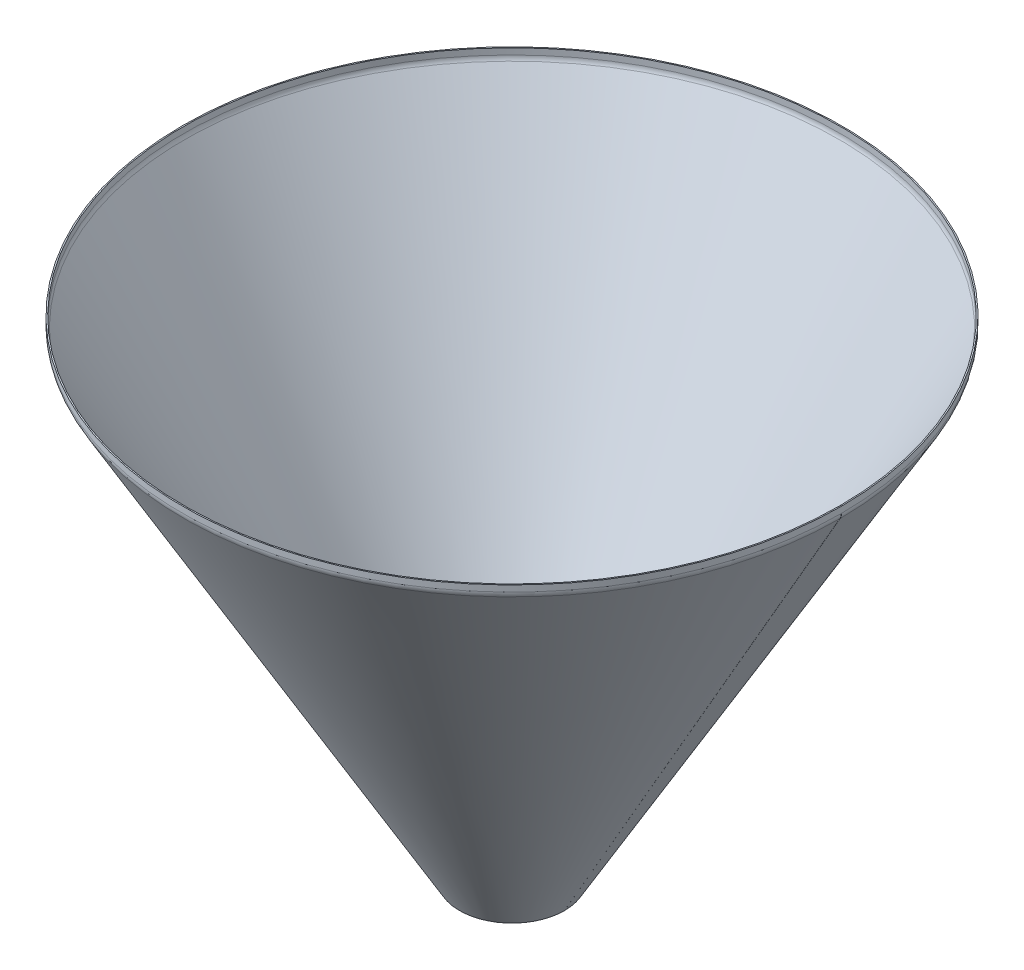
ISO-10303-21;
HEADER;
FILE_DESCRIPTION(('STEP AP214'),'2;1');
FILE_NAME('part.step','',(''),(''),'','','');
FILE_SCHEMA(('AUTOMOTIVE_DESIGN { 1 0 10303 214 1 1 1 1 }'));
ENDSEC;
DATA;
#1=APPLICATION_CONTEXT('core data for automotive mechanical design processes');
#2=APPLICATION_PROTOCOL_DEFINITION('international standard','automotive_design',2000,#1);
#3=PRODUCT_CONTEXT('',#1,'mechanical');
#4=PRODUCT('Part','Part','',(#3));
#5=PRODUCT_RELATED_PRODUCT_CATEGORY('part','',(#4));
#6=PRODUCT_DEFINITION_FORMATION('','',#4);
#7=PRODUCT_DEFINITION_CONTEXT('part definition',#1,'design');
#8=PRODUCT_DEFINITION('design','',#6,#7);
#9=PRODUCT_DEFINITION_SHAPE('','',#8);
#10=(LENGTH_UNIT() NAMED_UNIT(*) SI_UNIT(.MILLI.,.METRE.));
#11=(NAMED_UNIT(*) PLANE_ANGLE_UNIT() SI_UNIT($,.RADIAN.));
#12=(NAMED_UNIT(*) SI_UNIT($,.STERADIAN.) SOLID_ANGLE_UNIT());
#13=UNCERTAINTY_MEASURE_WITH_UNIT(LENGTH_MEASURE(1.E-05),#10,'distance_accuracy_value','');
#14=(GEOMETRIC_REPRESENTATION_CONTEXT(3) GLOBAL_UNCERTAINTY_ASSIGNED_CONTEXT((#13)) GLOBAL_UNIT_ASSIGNED_CONTEXT((#10,
#11,#12)) REPRESENTATION_CONTEXT('',''));
#15=CARTESIAN_POINT('',(0.,0.,0.));
#16=DIRECTION('',(0.,0.,1.));
#17=DIRECTION('',(1.,0.,0.));
#18=AXIS2_PLACEMENT_3D('',#15,#16,#17);
#19=CARTESIAN_POINT('',(-25.0002950981067,-15.,0.676314999307887));
#20=DIRECTION('',(0.000872664515235983,0.,-0.999999619228249));
#21=DIRECTION('',(-0.999999619228249,0.,-0.000872664515235983));
#22=AXIS2_PLACEMENT_3D('',#19,#20,#21);
#23=PLANE('',#22);
#24=DIRECTION('',(-0.999999619228249,0.,-0.000872664515236227));
#25=VECTOR('',#24,1.);
#26=CARTESIAN_POINT('',(-0.000304617400415097,-15.,0.698131612188983));
#27=LINE('',#26,#25);
#28=CARTESIAN_POINT('',(-0.000304617400415097,-15.,0.698131612188983));
#29=VERTEX_POINT('',#28);
#30=CARTESIAN_POINT('',(-3.00030347508518,-14.9999999999999,0.695513618643305));
#31=VERTEX_POINT('',#30);
#32=EDGE_CURVE('E11',#29,#31,#27,.T.);
#33=ORIENTED_EDGE('',*,*,#32,.F.);
#34=CARTESIAN_POINT('',(-25.0002950981067,-15.,0.676314999307887));
#35=DIRECTION('',(-0.000872664515235983,0.,0.999999619228249));
#36=DIRECTION('',(0.999999619228249,0.,0.000872664515235983));
#37=AXIS2_PLACEMENT_3D('',#34,#35,#36);
#38=CIRCLE('',#37,25.);
#39=CARTESIAN_POINT('',(-3.34966824744598,-27.5,0.695208740287472));
#40=VERTEX_POINT('',#39);
#41=EDGE_CURVE('E139',#40,#29,#38,.T.);
#42=ORIENTED_EDGE('',*,*,#41,.F.);
#43=DIRECTION('',(-0.866025074026429,0.500000000000001,-0.000755749639175806));
#44=VECTOR('',#43,1.);
#45=CARTESIAN_POINT('',(-3.34966824744598,-27.5,0.695208740287472));
#46=LINE('',#45,#44);
#47=CARTESIAN_POINT('',(-5.94774346952531,-26.,0.692941491369975));
#48=VERTEX_POINT('',#47);
#49=EDGE_CURVE('E52',#40,#48,#46,.T.);
#50=ORIENTED_EDGE('',*,*,#49,.T.);
#51=CARTESIAN_POINT('',(-25.0002950981068,-15.,0.676314999307935));
#52=DIRECTION('',(-0.000872664515236045,0.,0.999999619228249));
#53=DIRECTION('',(0.999999619228249,0.,0.000872664515236045));
#54=AXIS2_PLACEMENT_3D('',#51,#52,#53);
#55=CIRCLE('',#54,22.);
#56=EDGE_CURVE('E136',#48,#31,#55,.T.);
#57=ORIENTED_EDGE('',*,*,#56,.T.);
#58=EDGE_LOOP('',(#33,#42,#50,#57));
#59=FACE_BOUND('',#58,.T.);
#60=ADVANCED_FACE('F42',(#59),#23,.T.);
#61=CARTESIAN_POINT('',(-3.34966824744592,-27.5,0.695208740287277));
#62=DIRECTION('',(0.000872664515235983,0.,-0.999999619228249));
#63=DIRECTION('',(0.499999809614126,0.866025403784438,0.000436332257617993));
#64=AXIS2_PLACEMENT_3D('',#61,#62,#63);
#65=PLANE('',#64);
#66=ORIENTED_EDGE('',*,*,#49,.F.);
#67=DIRECTION('',(0.499999809614126,0.866025403784438,0.000436332257617993));
#68=VECTOR('',#67,1.);
#69=CARTESIAN_POINT('',(-3.34966824744592,-27.5,0.695208740287277));
#70=LINE('',#69,#68);
#71=CARTESIAN_POINT('',(-672.500048548398,-1186.50289790085,0.111264725692619));
#72=VERTEX_POINT('',#71);
#73=EDGE_CURVE('E179',#72,#40,#70,.T.);
#74=ORIENTED_EDGE('',*,*,#73,.F.);
#75=DIRECTION('',(-0.866025074026429,0.500000000000001,-0.000755749639175805));
#76=VECTOR('',#75,1.);
#77=CARTESIAN_POINT('',(-672.500048548398,-1186.50289790085,0.111264725692619));
#78=LINE('',#77,#76);
#79=CARTESIAN_POINT('',(-675.098123770478,-1185.00289790084,0.108997476775069));
#80=VERTEX_POINT('',#79);
#81=EDGE_CURVE('E128',#72,#80,#78,.T.);
#82=ORIENTED_EDGE('',*,*,#81,.T.);
#83=DIRECTION('',(0.499999809614126,0.866025403784438,0.000436332257618023));
#84=VECTOR('',#83,1.);
#85=CARTESIAN_POINT('',(-675.098123770478,-1185.00289790084,0.108997476775069));
#86=LINE('',#85,#84);
#87=EDGE_CURVE('E156',#80,#48,#86,.T.);
#88=ORIENTED_EDGE('',*,*,#87,.T.);
#89=EDGE_LOOP('',(#66,#74,#82,#88));
#90=FACE_BOUND('',#89,.T.);
#91=ADVANCED_FACE('F157',(#90),#65,.T.);
#92=CARTESIAN_POINT('',(-800.,-1186.50289790085,0.));
#93=DIRECTION('',(0.,-1.,0.));
#94=DIRECTION('',(0.,0.,-1.));
#95=AXIS2_PLACEMENT_3D('',#92,#93,#94);
#96=CONICAL_SURFACE('',#95,127.5,1.0471975511966);
#97=ORIENTED_EDGE('',*,*,#81,.F.);
#98=CARTESIAN_POINT('',(-800.,-1186.50289790085,0.));
#99=DIRECTION('',(0.,1.,0.));
#100=DIRECTION('',(1.,0.,0.));
#101=AXIS2_PLACEMENT_3D('',#98,#99,#100);
#102=CIRCLE('',#101,127.5);
#103=CARTESIAN_POINT('',(-672.5,-1186.50289790085,0.));
#104=VERTEX_POINT('',#103);
#105=EDGE_CURVE('E106',#104,#72,#102,.T.);
#106=ORIENTED_EDGE('',*,*,#105,.F.);
#107=DIRECTION('',(-0.866025403784438,0.500000000000001,0.));
#108=VECTOR('',#107,1.);
#109=CARTESIAN_POINT('',(-672.5,-1186.50289790085,0.));
#110=LINE('',#109,#108);
#111=CARTESIAN_POINT('',(-675.098076211353,-1185.00289790084,0.));
#112=VERTEX_POINT('',#111);
#113=EDGE_CURVE('E125',#104,#112,#110,.T.);
#114=ORIENTED_EDGE('',*,*,#113,.T.);
#115=CARTESIAN_POINT('',(-800.,-1185.00289790084,0.));
#116=DIRECTION('',(0.,1.,0.));
#117=DIRECTION('',(0.,0.,1.));
#118=AXIS2_PLACEMENT_3D('',#115,#116,#117);
#119=CIRCLE('',#118,124.901923788647);
#120=EDGE_CURVE('E161',#112,#80,#119,.T.);
#121=ORIENTED_EDGE('',*,*,#120,.T.);
#122=EDGE_LOOP('',(#97,#106,#114,#121));
#123=FACE_BOUND('',#122,.T.);
#124=ADVANCED_FACE('F218',(#123),#96,.F.);
#125=CARTESIAN_POINT('',(-3.34936490538905,-27.5,0.));
#126=DIRECTION('',(0.,0.,-1.));
#127=DIRECTION('',(0.500000000000001,0.866025403784438,0.));
#128=AXIS2_PLACEMENT_3D('',#125,#126,#127);
#129=PLANE('',#128);
#130=ORIENTED_EDGE('',*,*,#113,.F.);
#131=DIRECTION('',(0.500000000000001,0.866025403784438,0.));
#132=VECTOR('',#131,1.);
#133=CARTESIAN_POINT('',(-3.34936490538905,-27.5,0.));
#134=LINE('',#133,#132);
#135=CARTESIAN_POINT('',(-3.34936490538906,-27.5,0.));
#136=VERTEX_POINT('',#135);
#137=EDGE_CURVE('E176',#104,#136,#134,.T.);
#138=ORIENTED_EDGE('',*,*,#137,.T.);
#139=DIRECTION('',(-0.866025403784438,0.500000000000001,0.));
#140=VECTOR('',#139,1.);
#141=CARTESIAN_POINT('',(-3.34936490538906,-27.5,0.));
#142=LINE('',#141,#140);
#143=CARTESIAN_POINT('',(-5.94744111674239,-26.,0.));
#144=VERTEX_POINT('',#143);
#145=EDGE_CURVE('E122',#136,#144,#142,.T.);
#146=ORIENTED_EDGE('',*,*,#145,.T.);
#147=DIRECTION('',(0.500000000000001,0.866025403784438,0.));
#148=VECTOR('',#147,1.);
#149=CARTESIAN_POINT('',(-675.098076211353,-1185.00289790084,0.));
#150=LINE('',#149,#148);
#151=EDGE_CURVE('E113',#112,#144,#150,.T.);
#152=ORIENTED_EDGE('',*,*,#151,.F.);
#153=EDGE_LOOP('',(#130,#138,#146,#152));
#154=FACE_BOUND('',#153,.T.);
#155=ADVANCED_FACE('F223',(#154),#129,.F.);
#156=CARTESIAN_POINT('',(-25.,-15.,0.));
#157=DIRECTION('',(0.,0.,-1.));
#158=DIRECTION('',(-1.,0.,0.));
#159=AXIS2_PLACEMENT_3D('',#156,#157,#158);
#160=PLANE('',#159);
#161=ORIENTED_EDGE('',*,*,#145,.F.);
#162=CARTESIAN_POINT('',(-25.,-15.,0.));
#163=DIRECTION('',(0.,0.,1.));
#164=DIRECTION('',(1.,0.,0.));
#165=AXIS2_PLACEMENT_3D('',#162,#163,#164);
#166=CIRCLE('',#165,25.);
#167=CARTESIAN_POINT('',(0.,-15.,0.));
#168=VERTEX_POINT('',#167);
#169=EDGE_CURVE('E107',#136,#168,#166,.T.);
#170=ORIENTED_EDGE('',*,*,#169,.T.);
#171=DIRECTION('',(-1.,0.,0.));
#172=VECTOR('',#171,1.);
#173=CARTESIAN_POINT('',(0.,-15.,0.));
#174=LINE('',#173,#172);
#175=CARTESIAN_POINT('',(-3.,-15.,0.));
#176=VERTEX_POINT('',#175);
#177=EDGE_CURVE('E96',#168,#176,#174,.T.);
#178=ORIENTED_EDGE('',*,*,#177,.T.);
#179=CARTESIAN_POINT('',(-25.,-15.,0.));
#180=DIRECTION('',(0.,0.,1.));
#181=DIRECTION('',(1.,0.,0.));
#182=AXIS2_PLACEMENT_3D('',#179,#180,#181);
#183=CIRCLE('',#182,22.);
#184=EDGE_CURVE('E116',#144,#176,#183,.T.);
#185=ORIENTED_EDGE('',*,*,#184,.F.);
#186=EDGE_LOOP('',(#161,#170,#178,#185));
#187=FACE_BOUND('',#186,.T.);
#188=ADVANCED_FACE('F204',(#187),#160,.F.);
#189=CARTESIAN_POINT('',(0.,-7.5,0.));
#190=DIRECTION('',(0.,0.,-1.));
#191=DIRECTION('',(0.,1.,0.));
#192=AXIS2_PLACEMENT_3D('',#189,#190,#191);
#193=PLANE('',#192);
#194=ORIENTED_EDGE('',*,*,#177,.F.);
#195=DIRECTION('',(0.,1.,0.));
#196=VECTOR('',#195,1.);
#197=CARTESIAN_POINT('',(0.,0.,0.));
#198=LINE('',#197,#196);
#199=CARTESIAN_POINT('',(0.,0.,0.));
#200=VERTEX_POINT('',#199);
#201=EDGE_CURVE('E99',#168,#200,#198,.T.);
#202=ORIENTED_EDGE('',*,*,#201,.T.);
#203=DIRECTION('',(-1.,0.,0.));
#204=VECTOR('',#203,1.);
#205=CARTESIAN_POINT('',(0.,0.,0.));
#206=LINE('',#205,#204);
#207=CARTESIAN_POINT('',(-3.,0.,0.));
#208=VERTEX_POINT('',#207);
#209=EDGE_CURVE('E85',#200,#208,#206,.T.);
#210=ORIENTED_EDGE('',*,*,#209,.T.);
#211=DIRECTION('',(0.,1.,0.));
#212=VECTOR('',#211,1.);
#213=CARTESIAN_POINT('',(-3.,-1186.50289790085,0.));
#214=LINE('',#213,#212);
#215=EDGE_CURVE('E171',#176,#208,#214,.T.);
#216=ORIENTED_EDGE('',*,*,#215,.F.);
#217=EDGE_LOOP('',(#194,#202,#210,#216));
#218=FACE_BOUND('',#217,.T.);
#219=ADVANCED_FACE('F100',(#218),#193,.F.);
#220=CARTESIAN_POINT('',(-800.,0.,0.));
#221=DIRECTION('',(0.,-1.,0.));
#222=DIRECTION('',(0.,0.,-1.));
#223=AXIS2_PLACEMENT_3D('',#220,#221,#222);
#224=PLANE('',#223);
#225=ORIENTED_EDGE('',*,*,#209,.F.);
#226=CARTESIAN_POINT('',(-800.,0.,0.));
#227=DIRECTION('',(0.,1.,0.));
#228=DIRECTION('',(1.,0.,0.));
#229=AXIS2_PLACEMENT_3D('',#226,#227,#228);
#230=CIRCLE('',#229,800.);
#231=CARTESIAN_POINT('',(-0.000304617400415097,0.,0.698131612188983));
#232=VERTEX_POINT('',#231);
#233=EDGE_CURVE('E89',#200,#232,#230,.T.);
#234=ORIENTED_EDGE('',*,*,#233,.T.);
#235=DIRECTION('',(-0.99999961922825,0.,-0.000872664515236228));
#236=VECTOR('',#235,1.);
#237=CARTESIAN_POINT('',(-0.000304617400415097,0.,0.698131612188983));
#238=LINE('',#237,#236);
#239=CARTESIAN_POINT('',(-3.00030347508518,0.,0.695513618643128));
#240=VERTEX_POINT('',#239);
#241=EDGE_CURVE('E46',#232,#240,#238,.T.);
#242=ORIENTED_EDGE('',*,*,#241,.T.);
#243=CARTESIAN_POINT('',(-800.,0.,0.));
#244=DIRECTION('',(0.,1.,0.));
#245=DIRECTION('',(0.,0.,1.));
#246=AXIS2_PLACEMENT_3D('',#243,#244,#245);
#247=CIRCLE('',#246,797.);
#248=EDGE_CURVE('E92',#208,#240,#247,.T.);
#249=ORIENTED_EDGE('',*,*,#248,.F.);
#250=EDGE_LOOP('',(#225,#234,#242,#249));
#251=FACE_BOUND('',#250,.T.);
#252=ADVANCED_FACE('F87',(#251),#224,.F.);
#253=CARTESIAN_POINT('',(-0.000304617400414179,-7.5,0.698131612188787));
#254=DIRECTION('',(0.000872664515235984,0.,-0.99999961922825));
#255=DIRECTION('',(0.,1.,0.));
#256=AXIS2_PLACEMENT_3D('',#253,#254,#255);
#257=PLANE('',#256);
#258=DIRECTION('',(0.,1.,0.));
#259=VECTOR('',#258,1.);
#260=CARTESIAN_POINT('',(-0.000304617400415097,0.,0.698131612188787));
#261=LINE('',#260,#259);
#262=EDGE_CURVE('E112',#29,#232,#261,.T.);
#263=ORIENTED_EDGE('',*,*,#262,.F.);
#264=ORIENTED_EDGE('',*,*,#32,.T.);
#265=DIRECTION('',(0.,1.,0.));
#266=VECTOR('',#265,1.);
#267=CARTESIAN_POINT('',(-3.00030347508518,-1186.50289790085,0.695513618643128));
#268=LINE('',#267,#266);
#269=EDGE_CURVE('E170',#31,#240,#268,.T.);
#270=ORIENTED_EDGE('',*,*,#269,.T.);
#271=ORIENTED_EDGE('',*,*,#241,.F.);
#272=EDGE_LOOP('',(#263,#264,#270,#271));
#273=FACE_BOUND('',#272,.T.);
#274=ADVANCED_FACE('F44',(#273),#257,.T.);
#275=CARTESIAN_POINT('',(-800.,-1186.50289790085,0.));
#276=DIRECTION('',(0.,1.,0.));
#277=DIRECTION('',(0.,0.,1.));
#278=AXIS2_PLACEMENT_3D('',#275,#276,#277);
#279=CYLINDRICAL_SURFACE('',#278,797.);
#280=ORIENTED_EDGE('',*,*,#248,.T.);
#281=ORIENTED_EDGE('',*,*,#269,.F.);
#282=CARTESIAN_POINT('',(-800.,-14.9999999999998,0.));
#283=DIRECTION('',(0.,1.,0.));
#284=DIRECTION('',(0.,0.,1.));
#285=AXIS2_PLACEMENT_3D('',#282,#283,#284);
#286=CIRCLE('',#285,797.);
#287=EDGE_CURVE('E153',#176,#31,#286,.T.);
#288=ORIENTED_EDGE('',*,*,#287,.F.);
#289=ORIENTED_EDGE('',*,*,#215,.T.);
#290=EDGE_LOOP('',(#280,#281,#288,#289));
#291=FACE_BOUND('',#290,.T.);
#292=ADVANCED_FACE('F206',(#291),#279,.F.);
#293=CARTESIAN_POINT('',(-800.,-15.,0.));
#294=DIRECTION('',(0.,1.,0.));
#295=DIRECTION('',(0.,0.,1.));
#296=AXIS2_PLACEMENT_3D('',#293,#294,#295);
#297=TOROIDAL_SURFACE('',#296,775.,22.);
#298=ORIENTED_EDGE('',*,*,#287,.T.);
#299=ORIENTED_EDGE('',*,*,#56,.F.);
#300=CARTESIAN_POINT('',(-800.,-26.,0.));
#301=DIRECTION('',(0.,1.,0.));
#302=DIRECTION('',(0.,0.,1.));
#303=AXIS2_PLACEMENT_3D('',#300,#301,#302);
#304=CIRCLE('',#303,794.052558883258);
#305=EDGE_CURVE('E151',#144,#48,#304,.T.);
#306=ORIENTED_EDGE('',*,*,#305,.F.);
#307=ORIENTED_EDGE('',*,*,#184,.T.);
#308=EDGE_LOOP('',(#298,#299,#306,#307));
#309=FACE_BOUND('',#308,.T.);
#310=ADVANCED_FACE('F147',(#309),#297,.F.);
#311=CARTESIAN_POINT('',(-800.,-1185.00289790084,0.));
#312=DIRECTION('',(0.,1.,0.));
#313=DIRECTION('',(0.,0.,1.));
#314=AXIS2_PLACEMENT_3D('',#311,#312,#313);
#315=CONICAL_SURFACE('',#314,124.901923788647,0.5235987755983);
#316=ORIENTED_EDGE('',*,*,#305,.T.);
#317=ORIENTED_EDGE('',*,*,#87,.F.);
#318=ORIENTED_EDGE('',*,*,#120,.F.);
#319=ORIENTED_EDGE('',*,*,#151,.T.);
#320=EDGE_LOOP('',(#316,#317,#318,#319));
#321=FACE_BOUND('',#320,.T.);
#322=ADVANCED_FACE('F163',(#321),#315,.F.);
#323=CARTESIAN_POINT('',(-800.,-1186.50289790085,0.));
#324=DIRECTION('',(0.,1.,0.));
#325=DIRECTION('',(0.,0.,1.));
#326=AXIS2_PLACEMENT_3D('',#323,#324,#325);
#327=CYLINDRICAL_SURFACE('',#326,800.);
#328=ORIENTED_EDGE('',*,*,#233,.F.);
#329=ORIENTED_EDGE('',*,*,#201,.F.);
#330=CARTESIAN_POINT('',(-800.,-14.9999999999999,0.));
#331=DIRECTION('',(0.,1.,0.));
#332=DIRECTION('',(1.,0.,0.));
#333=AXIS2_PLACEMENT_3D('',#330,#331,#332);
#334=CIRCLE('',#333,800.);
#335=EDGE_CURVE('E118',#168,#29,#334,.T.);
#336=ORIENTED_EDGE('',*,*,#335,.T.);
#337=ORIENTED_EDGE('',*,*,#262,.T.);
#338=EDGE_LOOP('',(#328,#329,#336,#337));
#339=FACE_BOUND('',#338,.T.);
#340=ADVANCED_FACE('F110',(#339),#327,.T.);
#341=CARTESIAN_POINT('',(-800.,-15.,0.));
#342=DIRECTION('',(0.,1.,0.));
#343=DIRECTION('',(0.,0.,1.));
#344=AXIS2_PLACEMENT_3D('',#341,#342,#343);
#345=TOROIDAL_SURFACE('',#344,775.,25.);
#346=ORIENTED_EDGE('',*,*,#335,.F.);
#347=ORIENTED_EDGE('',*,*,#169,.F.);
#348=CARTESIAN_POINT('',(-800.,-27.5000000000001,0.));
#349=DIRECTION('',(0.,1.,0.));
#350=DIRECTION('',(1.,0.,0.));
#351=AXIS2_PLACEMENT_3D('',#348,#349,#350);
#352=CIRCLE('',#351,796.650635094611);
#353=EDGE_CURVE('E182',#136,#40,#352,.T.);
#354=ORIENTED_EDGE('',*,*,#353,.T.);
#355=ORIENTED_EDGE('',*,*,#41,.T.);
#356=EDGE_LOOP('',(#346,#347,#354,#355));
#357=FACE_BOUND('',#356,.T.);
#358=ADVANCED_FACE('F190',(#357),#345,.T.);
#359=CARTESIAN_POINT('',(-800.,-1186.50289790085,0.));
#360=DIRECTION('',(0.,1.,0.));
#361=DIRECTION('',(0.,0.,1.));
#362=AXIS2_PLACEMENT_3D('',#359,#360,#361);
#363=CONICAL_SURFACE('',#362,127.5,0.5235987755983);
#364=ORIENTED_EDGE('',*,*,#353,.F.);
#365=ORIENTED_EDGE('',*,*,#137,.F.);
#366=ORIENTED_EDGE('',*,*,#105,.T.);
#367=ORIENTED_EDGE('',*,*,#73,.T.);
#368=EDGE_LOOP('',(#364,#365,#366,#367));
#369=FACE_BOUND('',#368,.T.);
#370=ADVANCED_FACE('F237',(#369),#363,.T.);
#371=CLOSED_SHELL('',(#60,#91,#124,#155,#188,#219,#252,#274,#292,#310,#322,#340,#358,#370));
#372=MANIFOLD_SOLID_BREP('B2',#371);
#373=ADVANCED_BREP_SHAPE_REPRESENTATION('',(#18,#372),#14);
#374=SHAPE_DEFINITION_REPRESENTATION(#9,#373);
ENDSEC;
END-ISO-10303-21;
